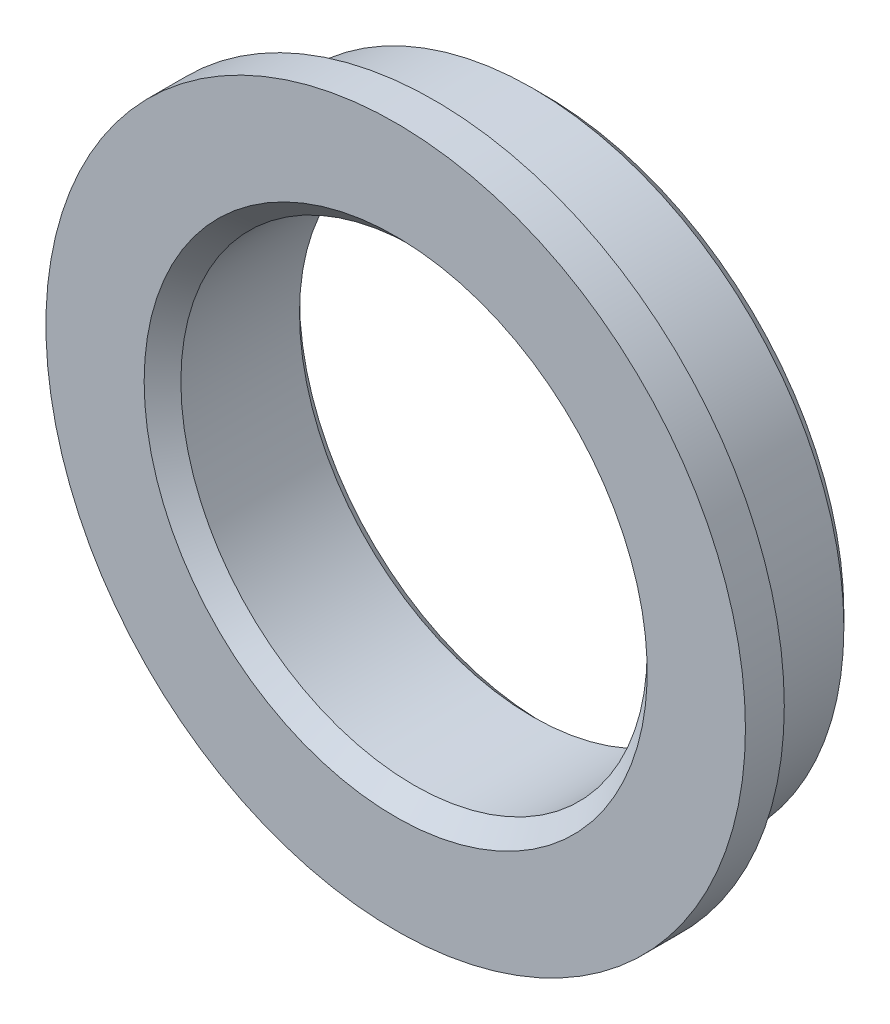
ISO-10303-21;
HEADER;
FILE_DESCRIPTION(('STEP AP214'),'2;1');
FILE_NAME('part.step','',(''),(''),'','','');
FILE_SCHEMA(('AUTOMOTIVE_DESIGN { 1 0 10303 214 1 1 1 1 }'));
ENDSEC;
DATA;
#1=APPLICATION_CONTEXT('core data for automotive mechanical design processes');
#2=APPLICATION_PROTOCOL_DEFINITION('international standard','automotive_design',2000,#1);
#3=PRODUCT_CONTEXT('',#1,'mechanical');
#4=PRODUCT('Part','Part','',(#3));
#5=PRODUCT_RELATED_PRODUCT_CATEGORY('part','',(#4));
#6=PRODUCT_DEFINITION_FORMATION('','',#4);
#7=PRODUCT_DEFINITION_CONTEXT('part definition',#1,'design');
#8=PRODUCT_DEFINITION('design','',#6,#7);
#9=PRODUCT_DEFINITION_SHAPE('','',#8);
#10=(LENGTH_UNIT() NAMED_UNIT(*) SI_UNIT(.MILLI.,.METRE.));
#11=(NAMED_UNIT(*) PLANE_ANGLE_UNIT() SI_UNIT($,.RADIAN.));
#12=(NAMED_UNIT(*) SI_UNIT($,.STERADIAN.) SOLID_ANGLE_UNIT());
#13=UNCERTAINTY_MEASURE_WITH_UNIT(LENGTH_MEASURE(1.E-05),#10,'distance_accuracy_value','');
#14=(GEOMETRIC_REPRESENTATION_CONTEXT(3) GLOBAL_UNCERTAINTY_ASSIGNED_CONTEXT((#13)) GLOBAL_UNIT_ASSIGNED_CONTEXT((#10,
#11,#12)) REPRESENTATION_CONTEXT('',''));
#15=CARTESIAN_POINT('',(0.,0.,0.));
#16=DIRECTION('',(0.,0.,1.));
#17=DIRECTION('',(1.,0.,0.));
#18=AXIS2_PLACEMENT_3D('',#15,#16,#17);
#19=CARTESIAN_POINT('',(0.,9.525,-3.048));
#20=DIRECTION('',(0.,0.,1.));
#21=DIRECTION('',(-1.,0.,0.));
#22=AXIS2_PLACEMENT_3D('',#19,#20,#21);
#23=PLANE('',#22);
#24=CARTESIAN_POINT('',(0.,0.,-3.048));
#25=DIRECTION('',(0.,0.,-1.));
#26=DIRECTION('',(-1.,0.,0.));
#27=AXIS2_PLACEMENT_3D('',#24,#25,#26);
#28=CIRCLE('',#27,12.2127);
#29=CARTESIAN_POINT('',(-12.2127,0.,-3.048));
#30=VERTEX_POINT('',#29);
#31=EDGE_CURVE('E38',#30,#30,#28,.T.);
#32=ORIENTED_EDGE('',*,*,#31,.T.);
#33=EDGE_LOOP('',(#32));
#34=FACE_BOUND('',#33,.T.);
#35=CARTESIAN_POINT('',(0.,0.,-3.048));
#36=DIRECTION('',(0.,0.,1.));
#37=DIRECTION('',(1.,0.,0.));
#38=AXIS2_PLACEMENT_3D('',#35,#36,#37);
#39=CIRCLE('',#38,10.025);
#40=CARTESIAN_POINT('',(10.025,0.,-3.048));
#41=VERTEX_POINT('',#40);
#42=EDGE_CURVE('E59',#41,#41,#39,.F.);
#43=ORIENTED_EDGE('',*,*,#42,.F.);
#44=EDGE_LOOP('',(#43));
#45=FACE_BOUND('',#44,.T.);
#46=ADVANCED_FACE('F35',(#34,#45),#23,.F.);
#47=CARTESIAN_POINT('',(0.,0.,-2.548));
#48=DIRECTION('',(0.,0.,1.));
#49=DIRECTION('',(-1.,0.,0.));
#50=AXIS2_PLACEMENT_3D('',#47,#48,#49);
#51=CONICAL_SURFACE('',#50,12.7127,0.785398163397447);
#52=CARTESIAN_POINT('',(0.,0.,-2.548));
#53=DIRECTION('',(0.,0.,1.));
#54=DIRECTION('',(1.,0.,0.));
#55=AXIS2_PLACEMENT_3D('',#52,#53,#54);
#56=CIRCLE('',#55,12.7127);
#57=CARTESIAN_POINT('',(12.7127,0.,-2.548));
#58=VERTEX_POINT('',#57);
#59=EDGE_CURVE('E50',#58,#58,#56,.F.);
#60=ORIENTED_EDGE('',*,*,#59,.T.);
#61=EDGE_LOOP('',(#60));
#62=FACE_BOUND('',#61,.T.);
#63=ORIENTED_EDGE('',*,*,#31,.F.);
#64=EDGE_LOOP('',(#63));
#65=FACE_BOUND('',#64,.T.);
#66=ADVANCED_FACE('F69',(#62,#65),#51,.T.);
#67=CARTESIAN_POINT('',(0.,0.,-3.048));
#68=DIRECTION('',(0.,0.,-1.));
#69=DIRECTION('',(1.,0.,0.));
#70=AXIS2_PLACEMENT_3D('',#67,#68,#69);
#71=CONICAL_SURFACE('',#70,10.025,0.785398163397446);
#72=ORIENTED_EDGE('',*,*,#42,.T.);
#73=EDGE_LOOP('',(#72));
#74=FACE_BOUND('',#73,.T.);
#75=CARTESIAN_POINT('',(0.,0.,-2.54799999999999));
#76=DIRECTION('',(0.,0.,1.));
#77=DIRECTION('',(1.,0.,0.));
#78=AXIS2_PLACEMENT_3D('',#75,#76,#77);
#79=CIRCLE('',#78,9.525);
#80=CARTESIAN_POINT('',(9.525,0.,-2.54799999999999));
#81=VERTEX_POINT('',#80);
#82=EDGE_CURVE('E58',#81,#81,#79,.F.);
#83=ORIENTED_EDGE('',*,*,#82,.F.);
#84=EDGE_LOOP('',(#83));
#85=FACE_BOUND('',#84,.T.);
#86=ADVANCED_FACE('F71',(#74,#85),#71,.F.);
#87=CARTESIAN_POINT('',(0.,0.,-4.09575));
#88=DIRECTION('',(0.,0.,-1.));
#89=DIRECTION('',(1.,0.,0.));
#90=AXIS2_PLACEMENT_3D('',#87,#88,#89);
#91=CYLINDRICAL_SURFACE('',#90,12.7127);
#92=ORIENTED_EDGE('',*,*,#59,.F.);
#93=EDGE_LOOP('',(#92));
#94=FACE_BOUND('',#93,.T.);
#95=CARTESIAN_POINT('',(0.,0.,1.4605));
#96=DIRECTION('',(0.,0.,1.));
#97=DIRECTION('',(1.,0.,0.));
#98=AXIS2_PLACEMENT_3D('',#95,#96,#97);
#99=CIRCLE('',#98,12.7127);
#100=CARTESIAN_POINT('',(12.7127,0.,1.4605));
#101=VERTEX_POINT('',#100);
#102=EDGE_CURVE('E56',#101,#101,#99,.T.);
#103=ORIENTED_EDGE('',*,*,#102,.F.);
#104=EDGE_LOOP('',(#103));
#105=FACE_BOUND('',#104,.T.);
#106=ADVANCED_FACE('F77',(#94,#105),#91,.T.);
#107=CARTESIAN_POINT('',(0.,0.,-4.09575));
#108=DIRECTION('',(0.,0.,-1.));
#109=DIRECTION('',(1.,0.,0.));
#110=AXIS2_PLACEMENT_3D('',#107,#108,#109);
#111=CYLINDRICAL_SURFACE('',#110,9.525);
#112=ORIENTED_EDGE('',*,*,#82,.T.);
#113=EDGE_LOOP('',(#112));
#114=FACE_BOUND('',#113,.T.);
#115=CARTESIAN_POINT('',(0.,0.,2.298));
#116=DIRECTION('',(0.,0.,-1.));
#117=DIRECTION('',(-1.,0.,0.));
#118=AXIS2_PLACEMENT_3D('',#115,#116,#117);
#119=CIRCLE('',#118,9.525);
#120=CARTESIAN_POINT('',(-9.525,0.,2.298));
#121=VERTEX_POINT('',#120);
#122=EDGE_CURVE('E55',#121,#121,#119,.T.);
#123=ORIENTED_EDGE('',*,*,#122,.F.);
#124=EDGE_LOOP('',(#123));
#125=FACE_BOUND('',#124,.T.);
#126=ADVANCED_FACE('F82',(#114,#125),#111,.F.);
#127=CARTESIAN_POINT('',(0.,12.7127,1.4605));
#128=DIRECTION('',(0.,0.,1.));
#129=DIRECTION('',(-1.,0.,0.));
#130=AXIS2_PLACEMENT_3D('',#127,#128,#129);
#131=PLANE('',#130);
#132=CARTESIAN_POINT('',(0.,0.,1.4605));
#133=DIRECTION('',(0.,0.,1.));
#134=DIRECTION('',(1.,0.,0.));
#135=AXIS2_PLACEMENT_3D('',#132,#133,#134);
#136=CIRCLE('',#135,14.2875);
#137=CARTESIAN_POINT('',(14.2875,0.,1.4605));
#138=VERTEX_POINT('',#137);
#139=EDGE_CURVE('E47',#138,#138,#136,.F.);
#140=ORIENTED_EDGE('',*,*,#139,.T.);
#141=EDGE_LOOP('',(#140));
#142=FACE_BOUND('',#141,.T.);
#143=ORIENTED_EDGE('',*,*,#102,.T.);
#144=EDGE_LOOP('',(#143));
#145=FACE_BOUND('',#144,.T.);
#146=ADVANCED_FACE('F86',(#142,#145),#131,.F.);
#147=CARTESIAN_POINT('',(0.,0.,3.048));
#148=DIRECTION('',(0.,0.,1.));
#149=DIRECTION('',(-1.,0.,0.));
#150=AXIS2_PLACEMENT_3D('',#147,#148,#149);
#151=CONICAL_SURFACE('',#150,10.275,0.785398163397446);
#152=CARTESIAN_POINT('',(0.,0.,3.048));
#153=DIRECTION('',(0.,0.,-1.));
#154=DIRECTION('',(-1.,0.,0.));
#155=AXIS2_PLACEMENT_3D('',#152,#153,#154);
#156=CIRCLE('',#155,10.275);
#157=CARTESIAN_POINT('',(-10.275,0.,3.048));
#158=VERTEX_POINT('',#157);
#159=EDGE_CURVE('E42',#158,#158,#156,.T.);
#160=ORIENTED_EDGE('',*,*,#159,.F.);
#161=EDGE_LOOP('',(#160));
#162=FACE_BOUND('',#161,.T.);
#163=ORIENTED_EDGE('',*,*,#122,.T.);
#164=EDGE_LOOP('',(#163));
#165=FACE_BOUND('',#164,.T.);
#166=ADVANCED_FACE('F90',(#162,#165),#151,.F.);
#167=CARTESIAN_POINT('',(0.,0.,-4.09575));
#168=DIRECTION('',(0.,0.,-1.));
#169=DIRECTION('',(1.,0.,0.));
#170=AXIS2_PLACEMENT_3D('',#167,#168,#169);
#171=CYLINDRICAL_SURFACE('',#170,14.2875);
#172=ORIENTED_EDGE('',*,*,#139,.F.);
#173=EDGE_LOOP('',(#172));
#174=FACE_BOUND('',#173,.T.);
#175=CARTESIAN_POINT('',(0.,0.,3.048));
#176=DIRECTION('',(0.,0.,1.));
#177=DIRECTION('',(1.,0.,0.));
#178=AXIS2_PLACEMENT_3D('',#175,#176,#177);
#179=CIRCLE('',#178,14.2875);
#180=CARTESIAN_POINT('',(14.2875,0.,3.048));
#181=VERTEX_POINT('',#180);
#182=EDGE_CURVE('E10',#181,#181,#179,.T.);
#183=ORIENTED_EDGE('',*,*,#182,.F.);
#184=EDGE_LOOP('',(#183));
#185=FACE_BOUND('',#184,.T.);
#186=ADVANCED_FACE('F94',(#174,#185),#171,.T.);
#187=CARTESIAN_POINT('',(0.,14.2875,3.048));
#188=DIRECTION('',(0.,0.,-1.));
#189=DIRECTION('',(1.,0.,0.));
#190=AXIS2_PLACEMENT_3D('',#187,#188,#189);
#191=PLANE('',#190);
#192=ORIENTED_EDGE('',*,*,#182,.T.);
#193=EDGE_LOOP('',(#192));
#194=FACE_BOUND('',#193,.T.);
#195=ORIENTED_EDGE('',*,*,#159,.T.);
#196=EDGE_LOOP('',(#195));
#197=FACE_BOUND('',#196,.T.);
#198=ADVANCED_FACE('F98',(#194,#197),#191,.F.);
#199=CLOSED_SHELL('',(#46,#66,#86,#106,#126,#146,#166,#186,#198));
#200=MANIFOLD_SOLID_BREP('B2',#199);
#201=ADVANCED_BREP_SHAPE_REPRESENTATION('',(#18,#200),#14);
#202=SHAPE_DEFINITION_REPRESENTATION(#9,#201);
ENDSEC;
END-ISO-10303-21;
